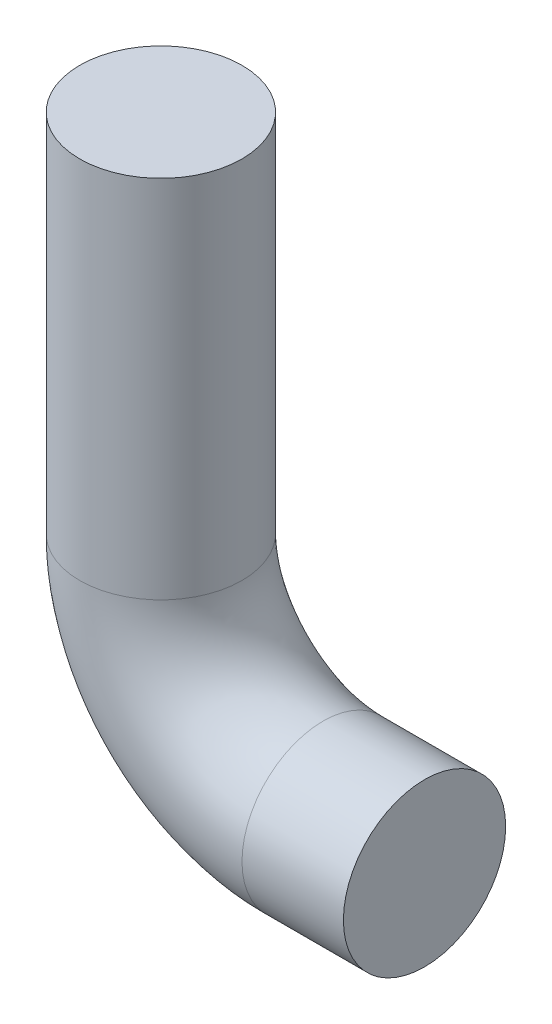
ISO-10303-21;
HEADER;
FILE_DESCRIPTION(('STEP AP214'),'2;1');
FILE_NAME('part.step','',(''),(''),'','','');
FILE_SCHEMA(('AUTOMOTIVE_DESIGN { 1 0 10303 214 1 1 1 1 }'));
ENDSEC;
DATA;
#1=APPLICATION_CONTEXT('core data for automotive mechanical design processes');
#2=APPLICATION_PROTOCOL_DEFINITION('international standard','automotive_design',2000,#1);
#3=PRODUCT_CONTEXT('',#1,'mechanical');
#4=PRODUCT('Part','Part','',(#3));
#5=PRODUCT_RELATED_PRODUCT_CATEGORY('part','',(#4));
#6=PRODUCT_DEFINITION_FORMATION('','',#4);
#7=PRODUCT_DEFINITION_CONTEXT('part definition',#1,'design');
#8=PRODUCT_DEFINITION('design','',#6,#7);
#9=PRODUCT_DEFINITION_SHAPE('','',#8);
#10=(LENGTH_UNIT() NAMED_UNIT(*) SI_UNIT(.MILLI.,.METRE.));
#11=(NAMED_UNIT(*) PLANE_ANGLE_UNIT() SI_UNIT($,.RADIAN.));
#12=(NAMED_UNIT(*) SI_UNIT($,.STERADIAN.) SOLID_ANGLE_UNIT());
#13=UNCERTAINTY_MEASURE_WITH_UNIT(LENGTH_MEASURE(1.E-05),#10,'distance_accuracy_value','');
#14=(GEOMETRIC_REPRESENTATION_CONTEXT(3) GLOBAL_UNCERTAINTY_ASSIGNED_CONTEXT((#13)) GLOBAL_UNIT_ASSIGNED_CONTEXT((#10,
#11,#12)) REPRESENTATION_CONTEXT('',''));
#15=CARTESIAN_POINT('',(0.,0.,0.));
#16=DIRECTION('',(0.,0.,1.));
#17=DIRECTION('',(1.,0.,0.));
#18=AXIS2_PLACEMENT_3D('',#15,#16,#17);
#19=CARTESIAN_POINT('',(0.,0.,0.));
#20=DIRECTION('',(1.,0.,0.));
#21=DIRECTION('',(0.,0.,-1.));
#22=AXIS2_PLACEMENT_3D('',#19,#20,#21);
#23=PLANE('',#22);
#24=CARTESIAN_POINT('',(0.,0.,0.));
#25=DIRECTION('',(1.,0.,0.));
#26=DIRECTION('',(0.,0.,-1.));
#27=AXIS2_PLACEMENT_3D('',#24,#25,#26);
#28=CIRCLE('',#27,25.4);
#29=CARTESIAN_POINT('',(0.,0.,-25.4));
#30=VERTEX_POINT('',#29);
#31=EDGE_CURVE('E47',#30,#30,#28,.T.);
#32=ORIENTED_EDGE('',*,*,#31,.T.);
#33=EDGE_LOOP('',(#32));
#34=FACE_BOUND('',#33,.T.);
#35=ADVANCED_FACE('F35',(#34),#23,.T.);
#36=CARTESIAN_POINT('',(-82.55,165.1,0.));
#37=DIRECTION('',(0.,-1.,0.));
#38=DIRECTION('',(0.,0.,-1.));
#39=AXIS2_PLACEMENT_3D('',#36,#37,#38);
#40=PLANE('',#39);
#41=CARTESIAN_POINT('',(-82.55,165.1,0.));
#42=DIRECTION('',(0.,-1.,0.));
#43=DIRECTION('',(0.,0.,-1.));
#44=AXIS2_PLACEMENT_3D('',#41,#42,#43);
#45=CIRCLE('',#44,25.4);
#46=CARTESIAN_POINT('',(-82.55,165.1,-25.4));
#47=VERTEX_POINT('',#46);
#48=EDGE_CURVE('E11',#47,#47,#45,.T.);
#49=ORIENTED_EDGE('',*,*,#48,.F.);
#50=EDGE_LOOP('',(#49));
#51=FACE_BOUND('',#50,.T.);
#52=ADVANCED_FACE('F53',(#51),#40,.F.);
#53=CARTESIAN_POINT('',(0.,0.,0.));
#54=DIRECTION('',(-1.,0.,0.));
#55=DIRECTION('',(0.,-1.,0.));
#56=AXIS2_PLACEMENT_3D('',#53,#54,#55);
#57=CYLINDRICAL_SURFACE('',#56,25.4);
#58=CARTESIAN_POINT('',(-31.75,0.,0.));
#59=DIRECTION('',(1.,0.,0.));
#60=DIRECTION('',(0.,0.,-1.));
#61=AXIS2_PLACEMENT_3D('',#58,#59,#60);
#62=CIRCLE('',#61,25.4);
#63=CARTESIAN_POINT('',(-31.75,-25.4,0.));
#64=VERTEX_POINT('',#63);
#65=EDGE_CURVE('E78',#64,#64,#62,.T.);
#66=ORIENTED_EDGE('',*,*,#65,.T.);
#67=EDGE_LOOP('',(#66));
#68=FACE_BOUND('',#67,.T.);
#69=ORIENTED_EDGE('',*,*,#31,.F.);
#70=EDGE_LOOP('',(#69));
#71=FACE_BOUND('',#70,.T.);
#72=ADVANCED_FACE('F55',(#68,#71),#57,.T.);
#73=CARTESIAN_POINT('',(-31.75,50.8,0.));
#74=DIRECTION('',(0.,0.,-1.));
#75=DIRECTION('',(-1.,0.,0.));
#76=AXIS2_PLACEMENT_3D('',#73,#74,#75);
#77=TOROIDAL_SURFACE('',#76,50.8,25.4);
#78=CARTESIAN_POINT('',(-82.55,50.8,0.));
#79=DIRECTION('',(0.,-1.,0.));
#80=DIRECTION('',(0.,0.,-1.));
#81=AXIS2_PLACEMENT_3D('',#78,#79,#80);
#82=CIRCLE('',#81,25.4);
#83=CARTESIAN_POINT('',(-107.95,50.8,0.));
#84=VERTEX_POINT('',#83);
#85=EDGE_CURVE('E42',#84,#84,#82,.T.);
#86=CARTESIAN_POINT('',(-31.75,50.8,0.));
#87=DIRECTION('',(0.,0.,-1.));
#88=DIRECTION('',(-1.,0.,0.));
#89=AXIS2_PLACEMENT_3D('',#86,#87,#88);
#90=CIRCLE('',#89,76.2);
#91=EDGE_CURVE('',#64,#84,#90,.T.);
#92=ORIENTED_EDGE('',*,*,#65,.F.);
#93=ORIENTED_EDGE('',*,*,#85,.T.);
#94=ORIENTED_EDGE('',*,*,#91,.T.);
#95=ORIENTED_EDGE('',*,*,#91,.F.);
#96=EDGE_LOOP('',(#92,#94,#93,#95));
#97=FACE_BOUND('',#96,.T.);
#98=ADVANCED_FACE('F60',(#97),#77,.T.);
#99=CARTESIAN_POINT('',(-82.55,50.8,0.));
#100=DIRECTION('',(0.,1.,0.));
#101=DIRECTION('',(0.,0.,1.));
#102=AXIS2_PLACEMENT_3D('',#99,#100,#101);
#103=CYLINDRICAL_SURFACE('',#102,25.4);
#104=ORIENTED_EDGE('',*,*,#48,.T.);
#105=EDGE_LOOP('',(#104));
#106=FACE_BOUND('',#105,.T.);
#107=ORIENTED_EDGE('',*,*,#85,.F.);
#108=EDGE_LOOP('',(#107));
#109=FACE_BOUND('',#108,.T.);
#110=ADVANCED_FACE('F50',(#106,#109),#103,.T.);
#111=CLOSED_SHELL('',(#35,#52,#72,#98,#110));
#112=MANIFOLD_SOLID_BREP('B2',#111);
#113=ADVANCED_BREP_SHAPE_REPRESENTATION('',(#18,#112),#14);
#114=SHAPE_DEFINITION_REPRESENTATION(#9,#113);
ENDSEC;
END-ISO-10303-21;
